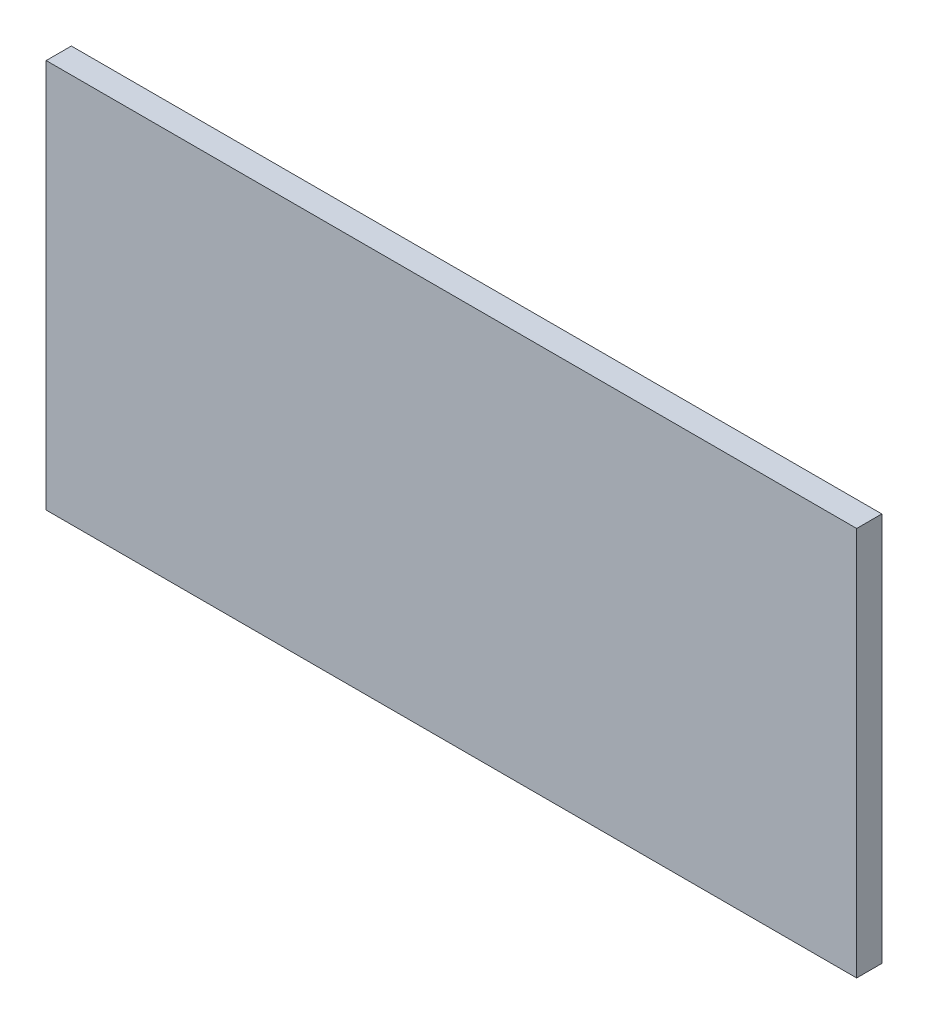
ISO-10303-21;
HEADER;
FILE_DESCRIPTION(('STEP AP214'),'2;1');
FILE_NAME('part.step','',(''),(''),'','','');
FILE_SCHEMA(('AUTOMOTIVE_DESIGN { 1 0 10303 214 1 1 1 1 }'));
ENDSEC;
DATA;
#1=APPLICATION_CONTEXT('core data for automotive mechanical design processes');
#2=APPLICATION_PROTOCOL_DEFINITION('international standard','automotive_design',2000,#1);
#3=PRODUCT_CONTEXT('',#1,'mechanical');
#4=PRODUCT('Part','Part','',(#3));
#5=PRODUCT_RELATED_PRODUCT_CATEGORY('part','',(#4));
#6=PRODUCT_DEFINITION_FORMATION('','',#4);
#7=PRODUCT_DEFINITION_CONTEXT('part definition',#1,'design');
#8=PRODUCT_DEFINITION('design','',#6,#7);
#9=PRODUCT_DEFINITION_SHAPE('','',#8);
#10=(LENGTH_UNIT() NAMED_UNIT(*) SI_UNIT(.MILLI.,.METRE.));
#11=(NAMED_UNIT(*) PLANE_ANGLE_UNIT() SI_UNIT($,.RADIAN.));
#12=(NAMED_UNIT(*) SI_UNIT($,.STERADIAN.) SOLID_ANGLE_UNIT());
#13=UNCERTAINTY_MEASURE_WITH_UNIT(LENGTH_MEASURE(1.E-05),#10,'distance_accuracy_value','');
#14=(GEOMETRIC_REPRESENTATION_CONTEXT(3) GLOBAL_UNCERTAINTY_ASSIGNED_CONTEXT((#13)) GLOBAL_UNIT_ASSIGNED_CONTEXT((#10,
#11,#12)) REPRESENTATION_CONTEXT('',''));
#15=CARTESIAN_POINT('',(0.,0.,0.));
#16=DIRECTION('',(0.,0.,1.));
#17=DIRECTION('',(1.,0.,0.));
#18=AXIS2_PLACEMENT_3D('',#15,#16,#17);
#19=CARTESIAN_POINT('',(90.8430023193359,100.912002563477,0.));
#20=DIRECTION('',(0.,1.,0.));
#21=DIRECTION('',(1.,0.,0.));
#22=AXIS2_PLACEMENT_3D('',#19,#20,#21);
#23=PLANE('',#22);
#24=DIRECTION('',(1.,0.,0.));
#25=VECTOR('',#24,1.);
#26=CARTESIAN_POINT('',(90.8430023193359,100.912002563477,0.03556));
#27=LINE('',#26,#25);
#28=CARTESIAN_POINT('',(90.8430023193359,100.912002563477,0.03556));
#29=VERTEX_POINT('',#28);
#30=CARTESIAN_POINT('',(91.9879989624023,100.912002563477,0.03556));
#31=VERTEX_POINT('',#30);
#32=EDGE_CURVE('E11',#29,#31,#27,.T.);
#33=ORIENTED_EDGE('',*,*,#32,.F.);
#34=DIRECTION('',(0.,0.,1.));
#35=VECTOR('',#34,1.);
#36=CARTESIAN_POINT('',(90.8430023193359,100.912002563477,0.));
#37=LINE('',#36,#35);
#38=CARTESIAN_POINT('',(90.8430023193359,100.912002563477,0.));
#39=VERTEX_POINT('',#38);
#40=EDGE_CURVE('E24',#39,#29,#37,.T.);
#41=ORIENTED_EDGE('',*,*,#40,.F.);
#42=DIRECTION('',(1.,0.,0.));
#43=VECTOR('',#42,1.);
#44=CARTESIAN_POINT('',(90.8430023193359,100.912002563477,0.));
#45=LINE('',#44,#43);
#46=CARTESIAN_POINT('',(91.9879989624023,100.912002563477,0.));
#47=VERTEX_POINT('',#46);
#48=EDGE_CURVE('E75',#39,#47,#45,.T.);
#49=ORIENTED_EDGE('',*,*,#48,.T.);
#50=DIRECTION('',(0.,0.,1.));
#51=VECTOR('',#50,1.);
#52=CARTESIAN_POINT('',(91.9879989624023,100.912002563477,0.));
#53=LINE('',#52,#51);
#54=EDGE_CURVE('E37',#47,#31,#53,.T.);
#55=ORIENTED_EDGE('',*,*,#54,.T.);
#56=EDGE_LOOP('',(#33,#41,#49,#55));
#57=FACE_BOUND('',#56,.T.);
#58=ADVANCED_FACE('F17',(#57),#23,.F.);
#59=CARTESIAN_POINT('',(91.9879989624023,100.912002563477,0.));
#60=DIRECTION('',(-1.,0.,0.));
#61=DIRECTION('',(0.,1.,0.));
#62=AXIS2_PLACEMENT_3D('',#59,#60,#61);
#63=PLANE('',#62);
#64=DIRECTION('',(0.,1.,0.));
#65=VECTOR('',#64,1.);
#66=CARTESIAN_POINT('',(91.9879989624023,100.912002563477,0.03556));
#67=LINE('',#66,#65);
#68=CARTESIAN_POINT('',(91.9879989624023,101.46199798584,0.03556));
#69=VERTEX_POINT('',#68);
#70=EDGE_CURVE('E83',#31,#69,#67,.T.);
#71=ORIENTED_EDGE('',*,*,#70,.F.);
#72=ORIENTED_EDGE('',*,*,#54,.F.);
#73=DIRECTION('',(0.,1.,0.));
#74=VECTOR('',#73,1.);
#75=CARTESIAN_POINT('',(91.9879989624023,100.912002563477,0.));
#76=LINE('',#75,#74);
#77=CARTESIAN_POINT('',(91.9879989624023,101.46199798584,0.));
#78=VERTEX_POINT('',#77);
#79=EDGE_CURVE('E81',#47,#78,#76,.T.);
#80=ORIENTED_EDGE('',*,*,#79,.T.);
#81=DIRECTION('',(0.,0.,1.));
#82=VECTOR('',#81,1.);
#83=CARTESIAN_POINT('',(91.9879989624023,101.46199798584,0.));
#84=LINE('',#83,#82);
#85=EDGE_CURVE('E67',#78,#69,#84,.T.);
#86=ORIENTED_EDGE('',*,*,#85,.T.);
#87=EDGE_LOOP('',(#71,#72,#80,#86));
#88=FACE_BOUND('',#87,.T.);
#89=ADVANCED_FACE('F89',(#88),#63,.F.);
#90=CARTESIAN_POINT('',(91.9879989624023,101.46199798584,0.));
#91=DIRECTION('',(0.,-1.,0.));
#92=DIRECTION('',(-1.,0.,0.));
#93=AXIS2_PLACEMENT_3D('',#90,#91,#92);
#94=PLANE('',#93);
#95=DIRECTION('',(-1.,0.,0.));
#96=VECTOR('',#95,1.);
#97=CARTESIAN_POINT('',(91.9879989624023,101.46199798584,0.03556));
#98=LINE('',#97,#96);
#99=CARTESIAN_POINT('',(90.8430023193359,101.46199798584,0.03556));
#100=VERTEX_POINT('',#99);
#101=EDGE_CURVE('E71',#69,#100,#98,.T.);
#102=ORIENTED_EDGE('',*,*,#101,.F.);
#103=ORIENTED_EDGE('',*,*,#85,.F.);
#104=DIRECTION('',(-1.,0.,0.));
#105=VECTOR('',#104,1.);
#106=CARTESIAN_POINT('',(91.9879989624023,101.46199798584,0.));
#107=LINE('',#106,#105);
#108=CARTESIAN_POINT('',(90.8430023193359,101.46199798584,0.));
#109=VERTEX_POINT('',#108);
#110=EDGE_CURVE('E63',#78,#109,#107,.T.);
#111=ORIENTED_EDGE('',*,*,#110,.T.);
#112=DIRECTION('',(0.,0.,1.));
#113=VECTOR('',#112,1.);
#114=CARTESIAN_POINT('',(90.8430023193359,101.46199798584,0.));
#115=LINE('',#114,#113);
#116=EDGE_CURVE('E53',#109,#100,#115,.T.);
#117=ORIENTED_EDGE('',*,*,#116,.T.);
#118=EDGE_LOOP('',(#102,#103,#111,#117));
#119=FACE_BOUND('',#118,.T.);
#120=ADVANCED_FACE('F66',(#119),#94,.F.);
#121=CARTESIAN_POINT('',(90.8430023193359,101.46199798584,0.));
#122=DIRECTION('',(1.,0.,0.));
#123=DIRECTION('',(0.,-1.,0.));
#124=AXIS2_PLACEMENT_3D('',#121,#122,#123);
#125=PLANE('',#124);
#126=DIRECTION('',(0.,-1.,0.));
#127=VECTOR('',#126,1.);
#128=CARTESIAN_POINT('',(90.8430023193359,101.46199798584,0.03556));
#129=LINE('',#128,#127);
#130=EDGE_CURVE('E59',#100,#29,#129,.T.);
#131=ORIENTED_EDGE('',*,*,#130,.F.);
#132=ORIENTED_EDGE('',*,*,#116,.F.);
#133=DIRECTION('',(0.,-1.,0.));
#134=VECTOR('',#133,1.);
#135=CARTESIAN_POINT('',(90.8430023193359,101.46199798584,0.));
#136=LINE('',#135,#134);
#137=EDGE_CURVE('E57',#109,#39,#136,.T.);
#138=ORIENTED_EDGE('',*,*,#137,.T.);
#139=ORIENTED_EDGE('',*,*,#40,.T.);
#140=EDGE_LOOP('',(#131,#132,#138,#139));
#141=FACE_BOUND('',#140,.T.);
#142=ADVANCED_FACE('F55',(#141),#125,.F.);
#143=CARTESIAN_POINT('',(90.8430023193359,100.912002563477,0.));
#144=DIRECTION('',(0.,0.,-1.));
#145=DIRECTION('',(-1.,0.,0.));
#146=AXIS2_PLACEMENT_3D('',#143,#144,#145);
#147=PLANE('',#146);
#148=ORIENTED_EDGE('',*,*,#137,.F.);
#149=ORIENTED_EDGE('',*,*,#110,.F.);
#150=ORIENTED_EDGE('',*,*,#79,.F.);
#151=ORIENTED_EDGE('',*,*,#48,.F.);
#152=EDGE_LOOP('',(#148,#149,#150,#151));
#153=FACE_BOUND('',#152,.T.);
#154=ADVANCED_FACE('F74',(#153),#147,.T.);
#155=CARTESIAN_POINT('',(90.8430023193359,100.912002563477,0.03556));
#156=DIRECTION('',(0.,0.,-1.));
#157=DIRECTION('',(-1.,0.,0.));
#158=AXIS2_PLACEMENT_3D('',#155,#156,#157);
#159=PLANE('',#158);
#160=ORIENTED_EDGE('',*,*,#32,.T.);
#161=ORIENTED_EDGE('',*,*,#70,.T.);
#162=ORIENTED_EDGE('',*,*,#101,.T.);
#163=ORIENTED_EDGE('',*,*,#130,.T.);
#164=EDGE_LOOP('',(#160,#161,#162,#163));
#165=FACE_BOUND('',#164,.T.);
#166=ADVANCED_FACE('F91',(#165),#159,.F.);
#167=CLOSED_SHELL('',(#58,#89,#120,#142,#154,#166));
#168=MANIFOLD_SOLID_BREP('B1',#167);
#169=ADVANCED_BREP_SHAPE_REPRESENTATION('',(#18,#168),#14);
#170=SHAPE_DEFINITION_REPRESENTATION(#9,#169);
ENDSEC;
END-ISO-10303-21;
